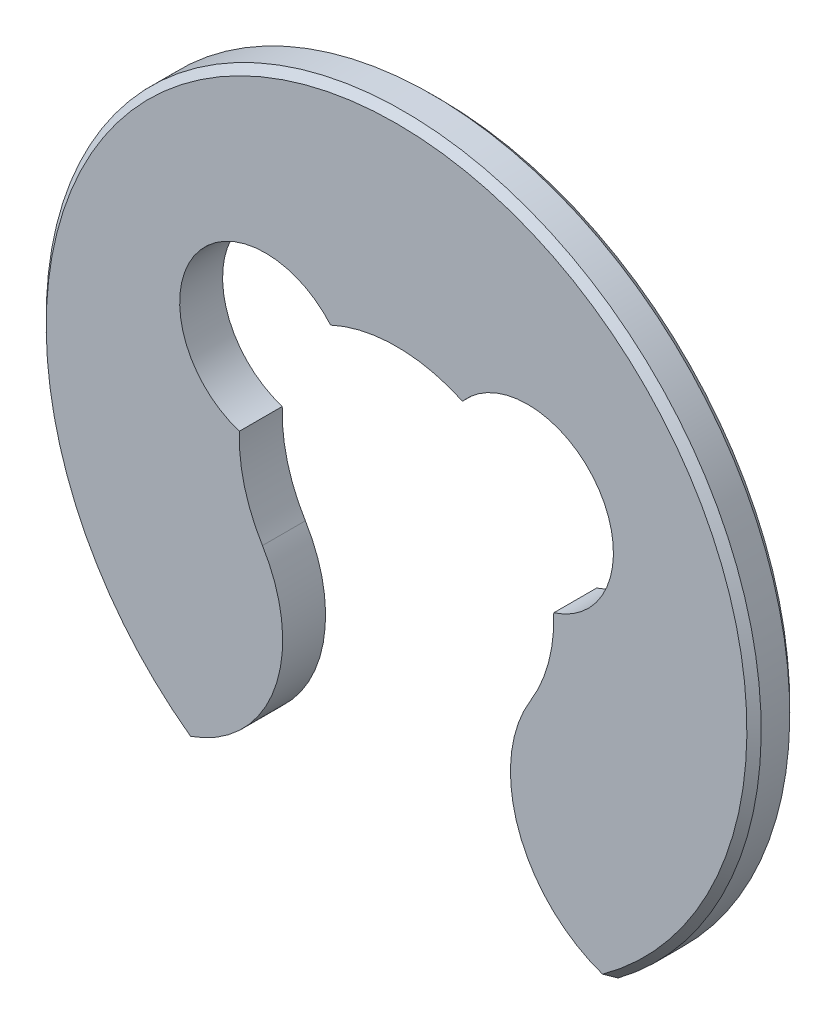
ISO-10303-21;
HEADER;
FILE_DESCRIPTION(('STEP AP214'),'2;1');
FILE_NAME('part.step','',(''),(''),'','','');
FILE_SCHEMA(('AUTOMOTIVE_DESIGN { 1 0 10303 214 1 1 1 1 }'));
ENDSEC;
DATA;
#1=APPLICATION_CONTEXT('core data for automotive mechanical design processes');
#2=APPLICATION_PROTOCOL_DEFINITION('international standard','automotive_design',2000,#1);
#3=PRODUCT_CONTEXT('',#1,'mechanical');
#4=PRODUCT('Part','Part','',(#3));
#5=PRODUCT_RELATED_PRODUCT_CATEGORY('part','',(#4));
#6=PRODUCT_DEFINITION_FORMATION('','',#4);
#7=PRODUCT_DEFINITION_CONTEXT('part definition',#1,'design');
#8=PRODUCT_DEFINITION('design','',#6,#7);
#9=PRODUCT_DEFINITION_SHAPE('','',#8);
#10=(LENGTH_UNIT() NAMED_UNIT(*) SI_UNIT(.MILLI.,.METRE.));
#11=(NAMED_UNIT(*) PLANE_ANGLE_UNIT() SI_UNIT($,.RADIAN.));
#12=(NAMED_UNIT(*) SI_UNIT($,.STERADIAN.) SOLID_ANGLE_UNIT());
#13=UNCERTAINTY_MEASURE_WITH_UNIT(LENGTH_MEASURE(1.E-05),#10,'distance_accuracy_value','');
#14=(GEOMETRIC_REPRESENTATION_CONTEXT(3) GLOBAL_UNCERTAINTY_ASSIGNED_CONTEXT((#13)) GLOBAL_UNIT_ASSIGNED_CONTEXT((#10,
#11,#12)) REPRESENTATION_CONTEXT('',''));
#15=CARTESIAN_POINT('',(0.,0.,0.));
#16=DIRECTION('',(0.,0.,1.));
#17=DIRECTION('',(1.,0.,0.));
#18=AXIS2_PLACEMENT_3D('',#15,#16,#17);
#19=CARTESIAN_POINT('',(0.,0.,0.3));
#20=DIRECTION('',(0.,0.,-1.));
#21=DIRECTION('',(-1.,0.,0.));
#22=AXIS2_PLACEMENT_3D('',#19,#20,#21);
#23=CYLINDRICAL_SURFACE('',#22,1.1);
#24=CARTESIAN_POINT('',(0.,0.,0.));
#25=DIRECTION('',(0.,0.,-1.));
#26=DIRECTION('',(1.,0.,0.));
#27=AXIS2_PLACEMENT_3D('',#24,#25,#26);
#28=CIRCLE('',#27,1.1);
#29=CARTESIAN_POINT('',(-0.461213416216044,0.998640167779329,0.));
#30=VERTEX_POINT('',#29);
#31=CARTESIAN_POINT('',(0.461213416216044,0.998640167779329,0.));
#32=VERTEX_POINT('',#31);
#33=EDGE_CURVE('E140',#30,#32,#28,.T.);
#34=ORIENTED_EDGE('',*,*,#33,.T.);
#35=DIRECTION('',(0.,0.,-1.));
#36=VECTOR('',#35,1.);
#37=CARTESIAN_POINT('',(0.461213416216044,0.998640167779329,0.3));
#38=LINE('',#37,#36);
#39=CARTESIAN_POINT('',(0.461213416216044,0.998640167779329,0.3));
#40=VERTEX_POINT('',#39);
#41=EDGE_CURVE('E120',#40,#32,#38,.T.);
#42=ORIENTED_EDGE('',*,*,#41,.F.);
#43=CARTESIAN_POINT('',(0.,0.,0.3));
#44=DIRECTION('',(0.,0.,-1.));
#45=DIRECTION('',(1.,0.,0.));
#46=AXIS2_PLACEMENT_3D('',#43,#44,#45);
#47=CIRCLE('',#46,1.1);
#48=CARTESIAN_POINT('',(-0.461213416216044,0.998640167779329,0.3));
#49=VERTEX_POINT('',#48);
#50=EDGE_CURVE('E127',#49,#40,#47,.T.);
#51=ORIENTED_EDGE('',*,*,#50,.F.);
#52=DIRECTION('',(0.,0.,-1.));
#53=VECTOR('',#52,1.);
#54=CARTESIAN_POINT('',(-0.461213416216044,0.998640167779329,0.3));
#55=LINE('',#54,#53);
#56=EDGE_CURVE('E221',#49,#30,#55,.T.);
#57=ORIENTED_EDGE('',*,*,#56,.T.);
#58=EDGE_LOOP('',(#34,#42,#51,#57));
#59=FACE_BOUND('',#58,.T.);
#60=ADVANCED_FACE('F37',(#59),#23,.F.);
#61=CARTESIAN_POINT('',(0.916666666666667,0.608047878231824,0.3));
#62=DIRECTION('',(0.,0.,-1.));
#63=DIRECTION('',(-1.,0.,0.));
#64=AXIS2_PLACEMENT_3D('',#61,#62,#63);
#65=CYLINDRICAL_SURFACE('',#64,0.6);
#66=CARTESIAN_POINT('',(0.916666666666667,0.608047878231824,0.));
#67=DIRECTION('',(0.,0.,-1.));
#68=DIRECTION('',(1.,0.,0.));
#69=AXIS2_PLACEMENT_3D('',#66,#67,#68);
#70=CIRCLE('',#69,0.6);
#71=CARTESIAN_POINT('',(1.09939264439002,0.0365487819376601,0.));
#72=VERTEX_POINT('',#71);
#73=EDGE_CURVE('E209',#32,#72,#70,.T.);
#74=ORIENTED_EDGE('',*,*,#73,.T.);
#75=DIRECTION('',(0.,0.,-1.));
#76=VECTOR('',#75,1.);
#77=CARTESIAN_POINT('',(1.09939264439002,0.0365487819376601,0.3));
#78=LINE('',#77,#76);
#79=CARTESIAN_POINT('',(1.09939264439002,0.0365487819376601,0.3));
#80=VERTEX_POINT('',#79);
#81=EDGE_CURVE('E123',#80,#72,#78,.T.);
#82=ORIENTED_EDGE('',*,*,#81,.F.);
#83=CARTESIAN_POINT('',(0.916666666666667,0.608047878231824,0.3));
#84=DIRECTION('',(0.,0.,-1.));
#85=DIRECTION('',(1.,0.,0.));
#86=AXIS2_PLACEMENT_3D('',#83,#84,#85);
#87=CIRCLE('',#86,0.6);
#88=EDGE_CURVE('E116',#40,#80,#87,.T.);
#89=ORIENTED_EDGE('',*,*,#88,.F.);
#90=ORIENTED_EDGE('',*,*,#41,.T.);
#91=EDGE_LOOP('',(#74,#82,#89,#90));
#92=FACE_BOUND('',#91,.T.);
#93=ADVANCED_FACE('F118',(#92),#65,.F.);
#94=CARTESIAN_POINT('',(0.,0.,0.3));
#95=DIRECTION('',(0.,0.,-1.));
#96=DIRECTION('',(-1.,0.,0.));
#97=AXIS2_PLACEMENT_3D('',#94,#95,#96);
#98=CYLINDRICAL_SURFACE('',#97,1.1);
#99=CARTESIAN_POINT('',(0.,0.,0.));
#100=DIRECTION('',(0.,0.,-1.));
#101=DIRECTION('',(1.,0.,0.));
#102=AXIS2_PLACEMENT_3D('',#99,#100,#101);
#103=CIRCLE('',#102,1.1);
#104=CARTESIAN_POINT('',(0.937747348521547,-0.57500426984572,0.));
#105=VERTEX_POINT('',#104);
#106=EDGE_CURVE('E205',#72,#105,#103,.T.);
#107=ORIENTED_EDGE('',*,*,#106,.T.);
#108=DIRECTION('',(0.,0.,-1.));
#109=VECTOR('',#108,1.);
#110=CARTESIAN_POINT('',(0.937747348521547,-0.57500426984572,0.3));
#111=LINE('',#110,#109);
#112=CARTESIAN_POINT('',(0.937747348521547,-0.57500426984572,0.3));
#113=VERTEX_POINT('',#112);
#114=EDGE_CURVE('E146',#113,#105,#111,.T.);
#115=ORIENTED_EDGE('',*,*,#114,.F.);
#116=CARTESIAN_POINT('',(0.,0.,0.3));
#117=DIRECTION('',(0.,0.,-1.));
#118=DIRECTION('',(1.,0.,0.));
#119=AXIS2_PLACEMENT_3D('',#116,#117,#118);
#120=CIRCLE('',#119,1.1);
#121=EDGE_CURVE('E126',#80,#113,#120,.T.);
#122=ORIENTED_EDGE('',*,*,#121,.F.);
#123=ORIENTED_EDGE('',*,*,#81,.T.);
#124=EDGE_LOOP('',(#107,#115,#122,#123));
#125=FACE_BOUND('',#124,.T.);
#126=ADVANCED_FACE('F177',(#125),#98,.F.);
#127=CARTESIAN_POINT('',(1.75484289378977,-1.07602773649895,0.3));
#128=DIRECTION('',(0.,0.,-1.));
#129=DIRECTION('',(-1.,0.,0.));
#130=AXIS2_PLACEMENT_3D('',#127,#128,#129);
#131=CYLINDRICAL_SURFACE('',#130,0.958472557893231);
#132=DIRECTION('',(0.,0.,-1.));
#133=VECTOR('',#132,1.);
#134=CARTESIAN_POINT('',(1.5,-2.,0.3));
#135=LINE('',#134,#133);
#136=CARTESIAN_POINT('',(1.5,-2.,0.25));
#137=VERTEX_POINT('',#136);
#138=CARTESIAN_POINT('',(1.5,-2.,0.0499999999999995));
#139=VERTEX_POINT('',#138);
#140=EDGE_CURVE('E212',#137,#139,#135,.T.);
#141=ORIENTED_EDGE('',*,*,#140,.F.);
#142=CARTESIAN_POINT('',(1.5,-2.,0.249999999999999));
#143=CARTESIAN_POINT('',(1.4899584090827,-1.99722780757836,0.258240825645457));
#144=CARTESIAN_POINT('',(1.48000209394557,-1.99430695633392,0.266527905387824));
#145=CARTESIAN_POINT('',(1.46026001641711,-1.98816793656803,0.283194572065594));
#146=CARTESIAN_POINT('',(1.45047425400529,-1.9849497680823,0.291574158989889));
#147=CARTESIAN_POINT('',(1.44077376735317,-1.98158294080946,0.299999999999982));
#148=B_SPLINE_CURVE_WITH_KNOTS('',3,(#142,#143,#144,#145,#146,#147),.UNSPECIFIED.,.F.,.F.,(4,2,
4),(0.,0.039837387763568,0.0796747707429279),.UNSPECIFIED.);
#149=CARTESIAN_POINT('',(1.44077376735318,-1.98158294080941,0.3));
#150=VERTEX_POINT('',#149);
#151=EDGE_CURVE('E46',#137,#150,#148,.T.);
#152=ORIENTED_EDGE('',*,*,#151,.T.);
#153=CARTESIAN_POINT('',(1.75484289378977,-1.07602773649895,0.3));
#154=DIRECTION('',(0.,0.,1.));
#155=DIRECTION('',(1.,0.,0.));
#156=AXIS2_PLACEMENT_3D('',#153,#154,#155);
#157=CIRCLE('',#156,0.958472557893231);
#158=EDGE_CURVE('E211',#113,#150,#157,.T.);
#159=ORIENTED_EDGE('',*,*,#158,.F.);
#160=ORIENTED_EDGE('',*,*,#114,.T.);
#161=CARTESIAN_POINT('',(1.75484289378977,-1.07602773649895,0.));
#162=DIRECTION('',(0.,0.,1.));
#163=DIRECTION('',(1.,0.,0.));
#164=AXIS2_PLACEMENT_3D('',#161,#162,#163);
#165=CIRCLE('',#164,0.958472557893231);
#166=CARTESIAN_POINT('',(1.44077376735319,-1.98158294080941,0.));
#167=VERTEX_POINT('',#166);
#168=EDGE_CURVE('E208',#105,#167,#165,.T.);
#169=ORIENTED_EDGE('',*,*,#168,.T.);
#170=CARTESIAN_POINT('',(1.44077376735319,-1.98158294080941,0.));
#171=CARTESIAN_POINT('',(1.45047425400531,-1.98494976808227,0.00842584101009836));
#172=CARTESIAN_POINT('',(1.46026001641712,-1.98816793656802,0.0168054279343984));
#173=CARTESIAN_POINT('',(1.48000209394556,-1.99430695633393,0.0334720946121801));
#174=CARTESIAN_POINT('',(1.48995840908268,-1.99722780757839,0.0417591743545522));
#175=CARTESIAN_POINT('',(1.49999999999997,-2.00000000000004,0.0500000000000163));
#176=B_SPLINE_CURVE_WITH_KNOTS('',3,(#170,#171,#172,#173,#174,#175),.UNSPECIFIED.,.F.,.F.,(4,2,
4),(0.,0.0398373829793599,0.0796747707429266),.UNSPECIFIED.);
#177=EDGE_CURVE('E58',#167,#139,#176,.T.);
#178=ORIENTED_EDGE('',*,*,#177,.T.);
#179=EDGE_LOOP('',(#141,#152,#159,#160,#169,#178));
#180=FACE_BOUND('',#179,.T.);
#181=ADVANCED_FACE('F172',(#180),#131,.T.);
#182=CARTESIAN_POINT('',(0.,0.,0.3));
#183=DIRECTION('',(0.,0.,-1.));
#184=DIRECTION('',(-1.,0.,0.));
#185=AXIS2_PLACEMENT_3D('',#182,#183,#184);
#186=CYLINDRICAL_SURFACE('',#185,2.5);
#187=DIRECTION('',(0.,0.,-1.));
#188=VECTOR('',#187,1.);
#189=CARTESIAN_POINT('',(-1.5,-2.,0.3));
#190=LINE('',#189,#188);
#191=CARTESIAN_POINT('',(-1.5,-2.,0.249999999999999));
#192=VERTEX_POINT('',#191);
#193=CARTESIAN_POINT('',(-1.5,-2.,0.0500000000000003));
#194=VERTEX_POINT('',#193);
#195=EDGE_CURVE('E229',#192,#194,#190,.T.);
#196=ORIENTED_EDGE('',*,*,#195,.F.);
#197=CARTESIAN_POINT('',(0.,0.,0.249999999999999));
#198=DIRECTION('',(0.,0.,1.));
#199=DIRECTION('',(1.,0.,0.));
#200=AXIS2_PLACEMENT_3D('',#197,#198,#199);
#201=CIRCLE('',#200,2.5);
#202=EDGE_CURVE('E237',#192,#137,#201,.F.);
#203=ORIENTED_EDGE('',*,*,#202,.T.);
#204=ORIENTED_EDGE('',*,*,#140,.T.);
#205=CARTESIAN_POINT('',(0.,0.,0.0500000000000001));
#206=DIRECTION('',(0.,0.,1.));
#207=DIRECTION('',(1.,0.,0.));
#208=AXIS2_PLACEMENT_3D('',#205,#206,#207);
#209=CIRCLE('',#208,2.5);
#210=EDGE_CURVE('E235',#139,#194,#209,.T.);
#211=ORIENTED_EDGE('',*,*,#210,.T.);
#212=EDGE_LOOP('',(#196,#203,#204,#211));
#213=FACE_BOUND('',#212,.T.);
#214=ADVANCED_FACE('F166',(#213),#186,.T.);
#215=CARTESIAN_POINT('',(-1.75484289378977,-1.07602773649895,0.3));
#216=DIRECTION('',(0.,0.,-1.));
#217=DIRECTION('',(-1.,0.,0.));
#218=AXIS2_PLACEMENT_3D('',#215,#216,#217);
#219=CYLINDRICAL_SURFACE('',#218,0.95847255789323);
#220=CARTESIAN_POINT('',(-1.75484289378977,-1.07602773649895,0.3));
#221=DIRECTION('',(0.,0.,1.));
#222=DIRECTION('',(-1.,0.,0.));
#223=AXIS2_PLACEMENT_3D('',#220,#221,#222);
#224=CIRCLE('',#223,0.95847255789323);
#225=CARTESIAN_POINT('',(-1.44077376735319,-1.98158294080941,0.3));
#226=VERTEX_POINT('',#225);
#227=CARTESIAN_POINT('',(-0.937747348521547,-0.57500426984572,0.3));
#228=VERTEX_POINT('',#227);
#229=EDGE_CURVE('E242',#226,#228,#224,.T.);
#230=ORIENTED_EDGE('',*,*,#229,.F.);
#231=CARTESIAN_POINT('',(-1.44077376735319,-1.98158294080941,0.3));
#232=CARTESIAN_POINT('',(-1.45047425400531,-1.98494976808227,0.291574158989901));
#233=CARTESIAN_POINT('',(-1.46026001641712,-1.98816793656802,0.283194572065601));
#234=CARTESIAN_POINT('',(-1.48000209394556,-1.99430695633393,0.266527905387819));
#235=CARTESIAN_POINT('',(-1.48995840908268,-1.99722780757839,0.258240825645447));
#236=CARTESIAN_POINT('',(-1.49999999999997,-2.00000000000004,0.249999999999983));
#237=B_SPLINE_CURVE_WITH_KNOTS('',3,(#231,#232,#233,#234,#235,#236),.UNSPECIFIED.,.F.,.F.,(4,2,
4),(0.,0.0398373829793608,0.0796747707429283),.UNSPECIFIED.);
#238=EDGE_CURVE('E155',#226,#192,#237,.T.);
#239=ORIENTED_EDGE('',*,*,#238,.T.);
#240=ORIENTED_EDGE('',*,*,#195,.T.);
#241=CARTESIAN_POINT('',(-1.5,-2.,0.0500000000000001));
#242=CARTESIAN_POINT('',(-1.4899584090827,-1.99722780757836,0.041759174354542));
#243=CARTESIAN_POINT('',(-1.48000209394557,-1.99430695633392,0.0334720946121757));
#244=CARTESIAN_POINT('',(-1.46026001641711,-1.98816793656803,0.0168054279344056));
#245=CARTESIAN_POINT('',(-1.45047425400529,-1.9849497680823,0.00842584101011142));
#246=CARTESIAN_POINT('',(-1.44077376735317,-1.98158294080946,0.));
#247=B_SPLINE_CURVE_WITH_KNOTS('',3,(#241,#242,#243,#244,#245,#246),.UNSPECIFIED.,.F.,.F.,(4,2,
4),(0.,0.0398373877635671,0.0796747707429262),.UNSPECIFIED.);
#248=CARTESIAN_POINT('',(-1.4407737673532,-1.98158294080941,0.));
#249=VERTEX_POINT('',#248);
#250=EDGE_CURVE('E144',#194,#249,#247,.T.);
#251=ORIENTED_EDGE('',*,*,#250,.T.);
#252=CARTESIAN_POINT('',(-1.75484289378977,-1.07602773649895,0.));
#253=DIRECTION('',(0.,0.,1.));
#254=DIRECTION('',(-1.,0.,0.));
#255=AXIS2_PLACEMENT_3D('',#252,#253,#254);
#256=CIRCLE('',#255,0.95847255789323);
#257=CARTESIAN_POINT('',(-0.937747348521547,-0.57500426984572,0.));
#258=VERTEX_POINT('',#257);
#259=EDGE_CURVE('E213',#249,#258,#256,.T.);
#260=ORIENTED_EDGE('',*,*,#259,.T.);
#261=DIRECTION('',(0.,0.,-1.));
#262=VECTOR('',#261,1.);
#263=CARTESIAN_POINT('',(-0.937747348521547,-0.57500426984572,0.3));
#264=LINE('',#263,#262);
#265=EDGE_CURVE('E226',#228,#258,#264,.T.);
#266=ORIENTED_EDGE('',*,*,#265,.F.);
#267=EDGE_LOOP('',(#230,#239,#240,#251,#260,#266));
#268=FACE_BOUND('',#267,.T.);
#269=ADVANCED_FACE('F160',(#268),#219,.T.);
#270=CARTESIAN_POINT('',(0.,0.,0.3));
#271=DIRECTION('',(0.,0.,-1.));
#272=DIRECTION('',(-1.,0.,0.));
#273=AXIS2_PLACEMENT_3D('',#270,#271,#272);
#274=CYLINDRICAL_SURFACE('',#273,1.1);
#275=CARTESIAN_POINT('',(0.,0.,0.));
#276=DIRECTION('',(0.,0.,-1.));
#277=DIRECTION('',(1.,0.,0.));
#278=AXIS2_PLACEMENT_3D('',#275,#276,#277);
#279=CIRCLE('',#278,1.1);
#280=CARTESIAN_POINT('',(-1.09939264439002,0.0365487819376596,0.));
#281=VERTEX_POINT('',#280);
#282=EDGE_CURVE('E215',#258,#281,#279,.T.);
#283=ORIENTED_EDGE('',*,*,#282,.T.);
#284=DIRECTION('',(0.,0.,-1.));
#285=VECTOR('',#284,1.);
#286=CARTESIAN_POINT('',(-1.09939264439002,0.0365487819376596,0.3));
#287=LINE('',#286,#285);
#288=CARTESIAN_POINT('',(-1.09939264439002,0.0365487819376596,0.3));
#289=VERTEX_POINT('',#288);
#290=EDGE_CURVE('E223',#289,#281,#287,.T.);
#291=ORIENTED_EDGE('',*,*,#290,.F.);
#292=CARTESIAN_POINT('',(0.,0.,0.3));
#293=DIRECTION('',(0.,0.,-1.));
#294=DIRECTION('',(1.,0.,0.));
#295=AXIS2_PLACEMENT_3D('',#292,#293,#294);
#296=CIRCLE('',#295,1.1);
#297=EDGE_CURVE('E245',#228,#289,#296,.T.);
#298=ORIENTED_EDGE('',*,*,#297,.F.);
#299=ORIENTED_EDGE('',*,*,#265,.T.);
#300=EDGE_LOOP('',(#283,#291,#298,#299));
#301=FACE_BOUND('',#300,.T.);
#302=ADVANCED_FACE('F165',(#301),#274,.F.);
#303=CARTESIAN_POINT('',(-0.916666666666667,0.608047878231824,0.3));
#304=DIRECTION('',(0.,0.,-1.));
#305=DIRECTION('',(-1.,0.,0.));
#306=AXIS2_PLACEMENT_3D('',#303,#304,#305);
#307=CYLINDRICAL_SURFACE('',#306,0.6);
#308=CARTESIAN_POINT('',(-0.916666666666667,0.608047878231824,0.));
#309=DIRECTION('',(0.,0.,-1.));
#310=DIRECTION('',(1.,0.,0.));
#311=AXIS2_PLACEMENT_3D('',#308,#309,#310);
#312=CIRCLE('',#311,0.6);
#313=EDGE_CURVE('E137',#281,#30,#312,.T.);
#314=ORIENTED_EDGE('',*,*,#313,.T.);
#315=ORIENTED_EDGE('',*,*,#56,.F.);
#316=CARTESIAN_POINT('',(-0.916666666666667,0.608047878231824,0.3));
#317=DIRECTION('',(0.,0.,-1.));
#318=DIRECTION('',(1.,0.,0.));
#319=AXIS2_PLACEMENT_3D('',#316,#317,#318);
#320=CIRCLE('',#319,0.6);
#321=EDGE_CURVE('E133',#289,#49,#320,.T.);
#322=ORIENTED_EDGE('',*,*,#321,.F.);
#323=ORIENTED_EDGE('',*,*,#290,.T.);
#324=EDGE_LOOP('',(#314,#315,#322,#323));
#325=FACE_BOUND('',#324,.T.);
#326=ADVANCED_FACE('F254',(#325),#307,.F.);
#327=CARTESIAN_POINT('',(-0.458333333333333,0.304023939115912,0.3));
#328=DIRECTION('',(0.,0.,1.));
#329=DIRECTION('',(1.,0.,0.));
#330=AXIS2_PLACEMENT_3D('',#327,#328,#329);
#331=PLANE('',#330);
#332=ORIENTED_EDGE('',*,*,#158,.T.);
#333=CARTESIAN_POINT('',(0.,0.,0.3));
#334=DIRECTION('',(0.,0.,1.));
#335=DIRECTION('',(1.,0.,0.));
#336=AXIS2_PLACEMENT_3D('',#333,#334,#335);
#337=CIRCLE('',#336,2.45);
#338=EDGE_CURVE('E141',#150,#226,#337,.T.);
#339=ORIENTED_EDGE('',*,*,#338,.T.);
#340=ORIENTED_EDGE('',*,*,#229,.T.);
#341=ORIENTED_EDGE('',*,*,#297,.T.);
#342=ORIENTED_EDGE('',*,*,#321,.T.);
#343=ORIENTED_EDGE('',*,*,#50,.T.);
#344=ORIENTED_EDGE('',*,*,#88,.T.);
#345=ORIENTED_EDGE('',*,*,#121,.T.);
#346=EDGE_LOOP('',(#332,#339,#340,#341,#342,#343,#344,#345));
#347=FACE_BOUND('',#346,.T.);
#348=ADVANCED_FACE('F131',(#347),#331,.T.);
#349=CARTESIAN_POINT('',(-0.458333333333333,0.304023939115912,0.));
#350=DIRECTION('',(0.,0.,1.));
#351=DIRECTION('',(1.,0.,0.));
#352=AXIS2_PLACEMENT_3D('',#349,#350,#351);
#353=PLANE('',#352);
#354=ORIENTED_EDGE('',*,*,#259,.F.);
#355=CARTESIAN_POINT('',(0.,0.,0.));
#356=DIRECTION('',(0.,0.,1.));
#357=DIRECTION('',(1.,0.,0.));
#358=AXIS2_PLACEMENT_3D('',#355,#356,#357);
#359=CIRCLE('',#358,2.45);
#360=EDGE_CURVE('E11',#249,#167,#359,.F.);
#361=ORIENTED_EDGE('',*,*,#360,.T.);
#362=ORIENTED_EDGE('',*,*,#168,.F.);
#363=ORIENTED_EDGE('',*,*,#106,.F.);
#364=ORIENTED_EDGE('',*,*,#73,.F.);
#365=ORIENTED_EDGE('',*,*,#33,.F.);
#366=ORIENTED_EDGE('',*,*,#313,.F.);
#367=ORIENTED_EDGE('',*,*,#282,.F.);
#368=EDGE_LOOP('',(#354,#361,#362,#363,#364,#365,#366,#367));
#369=FACE_BOUND('',#368,.T.);
#370=ADVANCED_FACE('F192',(#369),#353,.F.);
#371=CARTESIAN_POINT('',(0.,0.,0.3));
#372=DIRECTION('',(0.,0.,-1.));
#373=DIRECTION('',(-1.,0.,0.));
#374=AXIS2_PLACEMENT_3D('',#371,#372,#373);
#375=CONICAL_SURFACE('',#374,2.45,0.785398163397448);
#376=ORIENTED_EDGE('',*,*,#151,.F.);
#377=ORIENTED_EDGE('',*,*,#202,.F.);
#378=ORIENTED_EDGE('',*,*,#238,.F.);
#379=ORIENTED_EDGE('',*,*,#338,.F.);
#380=EDGE_LOOP('',(#376,#377,#378,#379));
#381=FACE_BOUND('',#380,.T.);
#382=ADVANCED_FACE('F188',(#381),#375,.T.);
#383=CARTESIAN_POINT('',(0.,0.,0.0500000000000001));
#384=DIRECTION('',(0.,0.,1.));
#385=DIRECTION('',(1.,0.,0.));
#386=AXIS2_PLACEMENT_3D('',#383,#384,#385);
#387=CONICAL_SURFACE('',#386,2.5,0.785398163397448);
#388=ORIENTED_EDGE('',*,*,#177,.F.);
#389=ORIENTED_EDGE('',*,*,#360,.F.);
#390=ORIENTED_EDGE('',*,*,#250,.F.);
#391=ORIENTED_EDGE('',*,*,#210,.F.);
#392=EDGE_LOOP('',(#388,#389,#390,#391));
#393=FACE_BOUND('',#392,.T.);
#394=ADVANCED_FACE('F39',(#393),#387,.T.);
#395=CLOSED_SHELL('',(#60,#93,#126,#181,#214,#269,#302,#326,#348,#370,#382,#394));
#396=MANIFOLD_SOLID_BREP('B2',#395);
#397=ADVANCED_BREP_SHAPE_REPRESENTATION('',(#18,#396),#14);
#398=SHAPE_DEFINITION_REPRESENTATION(#9,#397);
ENDSEC;
END-ISO-10303-21;
